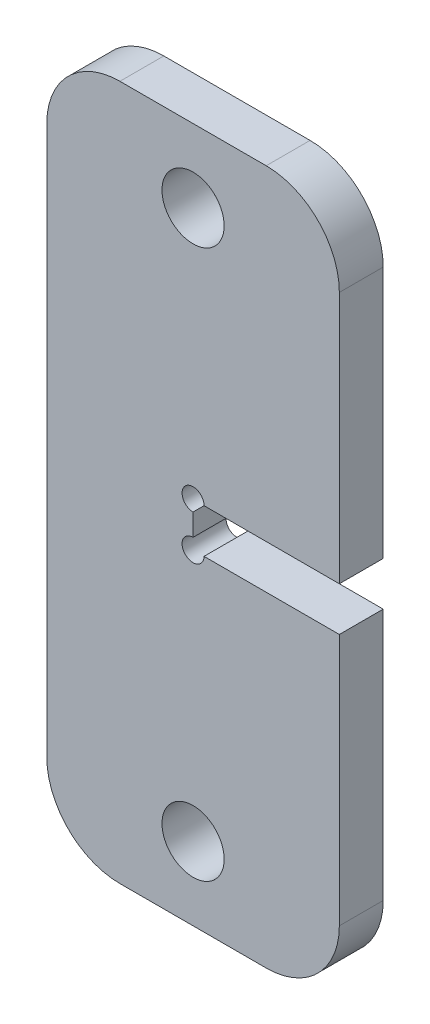
ISO-10303-21;
HEADER;
FILE_DESCRIPTION(('STEP AP214'),'2;1');
FILE_NAME('part.step','',(''),(''),'','','');
FILE_SCHEMA(('AUTOMOTIVE_DESIGN { 1 0 10303 214 1 1 1 1 }'));
ENDSEC;
DATA;
#1=APPLICATION_CONTEXT('core data for automotive mechanical design processes');
#2=APPLICATION_PROTOCOL_DEFINITION('international standard','automotive_design',2000,#1);
#3=PRODUCT_CONTEXT('',#1,'mechanical');
#4=PRODUCT('Part','Part','',(#3));
#5=PRODUCT_RELATED_PRODUCT_CATEGORY('part','',(#4));
#6=PRODUCT_DEFINITION_FORMATION('','',#4);
#7=PRODUCT_DEFINITION_CONTEXT('part definition',#1,'design');
#8=PRODUCT_DEFINITION('design','',#6,#7);
#9=PRODUCT_DEFINITION_SHAPE('','',#8);
#10=(LENGTH_UNIT() NAMED_UNIT(*) SI_UNIT(.MILLI.,.METRE.));
#11=(NAMED_UNIT(*) PLANE_ANGLE_UNIT() SI_UNIT($,.RADIAN.));
#12=(NAMED_UNIT(*) SI_UNIT($,.STERADIAN.) SOLID_ANGLE_UNIT());
#13=UNCERTAINTY_MEASURE_WITH_UNIT(LENGTH_MEASURE(1.E-05),#10,'distance_accuracy_value','');
#14=(GEOMETRIC_REPRESENTATION_CONTEXT(3) GLOBAL_UNCERTAINTY_ASSIGNED_CONTEXT((#13)) GLOBAL_UNIT_ASSIGNED_CONTEXT((#10,
#11,#12)) REPRESENTATION_CONTEXT('',''));
#15=CARTESIAN_POINT('',(0.,0.,0.));
#16=DIRECTION('',(0.,0.,1.));
#17=DIRECTION('',(1.,0.,0.));
#18=AXIS2_PLACEMENT_3D('',#15,#16,#17);
#19=CARTESIAN_POINT('',(681.,310.,6.00000000000001));
#20=DIRECTION('',(0.,0.,1.));
#21=DIRECTION('',(1.,0.,0.));
#22=AXIS2_PLACEMENT_3D('',#19,#20,#21);
#23=PLANE('',#22);
#24=CARTESIAN_POINT('',(691.,350.5,6.00000000000001));
#25=DIRECTION('',(0.,0.,1.));
#26=DIRECTION('',(1.,0.,0.));
#27=AXIS2_PLACEMENT_3D('',#24,#25,#26);
#28=CIRCLE('',#27,1.49999999999997);
#29=CARTESIAN_POINT('',(692.5,350.5,6.00000000000001));
#30=VERTEX_POINT('',#29);
#31=CARTESIAN_POINT('',(691.,349.,6.00000000000001));
#32=VERTEX_POINT('',#31);
#33=EDGE_CURVE('E140',#30,#32,#28,.T.);
#34=ORIENTED_EDGE('',*,*,#33,.F.);
#35=DIRECTION('',(1.,0.,0.));
#36=VECTOR('',#35,1.);
#37=CARTESIAN_POINT('',(691.,350.5,6.00000000000001));
#38=LINE('',#37,#36);
#39=CARTESIAN_POINT('',(711.,350.5,6.00000000000001));
#40=VERTEX_POINT('',#39);
#41=EDGE_CURVE('E150',#30,#40,#38,.T.);
#42=ORIENTED_EDGE('',*,*,#41,.T.);
#43=DIRECTION('',(0.,1.,0.));
#44=VECTOR('',#43,1.);
#45=CARTESIAN_POINT('',(711.,350.5,6.00000000000001));
#46=LINE('',#45,#44);
#47=CARTESIAN_POINT('',(711.,385.,6.00000000000001));
#48=VERTEX_POINT('',#47);
#49=EDGE_CURVE('E162',#40,#48,#46,.T.);
#50=ORIENTED_EDGE('',*,*,#49,.T.);
#51=CARTESIAN_POINT('',(701.,385.,6.00000000000001));
#52=DIRECTION('',(0.,0.,1.));
#53=DIRECTION('',(1.,0.,0.));
#54=AXIS2_PLACEMENT_3D('',#51,#52,#53);
#55=CIRCLE('',#54,10.);
#56=CARTESIAN_POINT('',(701.,395.,6.00000000000001));
#57=VERTEX_POINT('',#56);
#58=EDGE_CURVE('E167',#48,#57,#55,.T.);
#59=ORIENTED_EDGE('',*,*,#58,.T.);
#60=DIRECTION('',(-1.,0.,0.));
#61=VECTOR('',#60,1.);
#62=CARTESIAN_POINT('',(701.,395.,6.00000000000001));
#63=LINE('',#62,#61);
#64=CARTESIAN_POINT('',(681.,395.,6.00000000000001));
#65=VERTEX_POINT('',#64);
#66=EDGE_CURVE('E175',#57,#65,#63,.T.);
#67=ORIENTED_EDGE('',*,*,#66,.T.);
#68=CARTESIAN_POINT('',(681.,385.,6.00000000000001));
#69=DIRECTION('',(0.,0.,1.));
#70=DIRECTION('',(1.,0.,0.));
#71=AXIS2_PLACEMENT_3D('',#68,#69,#70);
#72=CIRCLE('',#71,10.);
#73=CARTESIAN_POINT('',(671.,385.,6.00000000000001));
#74=VERTEX_POINT('',#73);
#75=EDGE_CURVE('E178',#65,#74,#72,.T.);
#76=ORIENTED_EDGE('',*,*,#75,.T.);
#77=DIRECTION('',(0.,-1.,0.));
#78=VECTOR('',#77,1.);
#79=CARTESIAN_POINT('',(671.,385.,6.00000000000001));
#80=LINE('',#79,#78);
#81=CARTESIAN_POINT('',(671.,310.,6.00000000000001));
#82=VERTEX_POINT('',#81);
#83=EDGE_CURVE('E181',#74,#82,#80,.T.);
#84=ORIENTED_EDGE('',*,*,#83,.T.);
#85=CARTESIAN_POINT('',(681.,310.,6.00000000000001));
#86=DIRECTION('',(0.,0.,1.));
#87=DIRECTION('',(1.,0.,0.));
#88=AXIS2_PLACEMENT_3D('',#85,#86,#87);
#89=CIRCLE('',#88,10.);
#90=CARTESIAN_POINT('',(681.,300.,6.00000000000001));
#91=VERTEX_POINT('',#90);
#92=EDGE_CURVE('E225',#82,#91,#89,.T.);
#93=ORIENTED_EDGE('',*,*,#92,.T.);
#94=DIRECTION('',(1.,0.,0.));
#95=VECTOR('',#94,1.);
#96=CARTESIAN_POINT('',(681.,300.,6.00000000000001));
#97=LINE('',#96,#95);
#98=CARTESIAN_POINT('',(701.,300.,6.00000000000001));
#99=VERTEX_POINT('',#98);
#100=EDGE_CURVE('E266',#91,#99,#97,.T.);
#101=ORIENTED_EDGE('',*,*,#100,.T.);
#102=CARTESIAN_POINT('',(701.,310.,6.00000000000001));
#103=DIRECTION('',(0.,0.,1.));
#104=DIRECTION('',(1.,0.,0.));
#105=AXIS2_PLACEMENT_3D('',#102,#103,#104);
#106=CIRCLE('',#105,10.);
#107=CARTESIAN_POINT('',(711.,310.,6.00000000000001));
#108=VERTEX_POINT('',#107);
#109=EDGE_CURVE('E292',#99,#108,#106,.T.);
#110=ORIENTED_EDGE('',*,*,#109,.T.);
#111=DIRECTION('',(0.,1.,0.));
#112=VECTOR('',#111,1.);
#113=CARTESIAN_POINT('',(711.,310.,6.00000000000001));
#114=LINE('',#113,#112);
#115=CARTESIAN_POINT('',(711.,344.5,6.00000000000001));
#116=VERTEX_POINT('',#115);
#117=EDGE_CURVE('E288',#108,#116,#114,.T.);
#118=ORIENTED_EDGE('',*,*,#117,.T.);
#119=DIRECTION('',(-1.,0.,0.));
#120=VECTOR('',#119,1.);
#121=CARTESIAN_POINT('',(691.,344.5,6.00000000000001));
#122=LINE('',#121,#120);
#123=CARTESIAN_POINT('',(692.5,344.5,6.00000000000001));
#124=VERTEX_POINT('',#123);
#125=EDGE_CURVE('E170',#116,#124,#122,.T.);
#126=ORIENTED_EDGE('',*,*,#125,.T.);
#127=CARTESIAN_POINT('',(691.,344.5,6.00000000000001));
#128=DIRECTION('',(0.,0.,1.));
#129=DIRECTION('',(1.,0.,0.));
#130=AXIS2_PLACEMENT_3D('',#127,#128,#129);
#131=CIRCLE('',#130,1.49999999999997);
#132=CARTESIAN_POINT('',(691.,346.,6.00000000000001));
#133=VERTEX_POINT('',#132);
#134=EDGE_CURVE('E324',#133,#124,#131,.T.);
#135=ORIENTED_EDGE('',*,*,#134,.F.);
#136=DIRECTION('',(0.,1.,0.));
#137=VECTOR('',#136,1.);
#138=CARTESIAN_POINT('',(691.,350.5,6.00000000000001));
#139=LINE('',#138,#137);
#140=EDGE_CURVE('E154',#133,#32,#139,.T.);
#141=ORIENTED_EDGE('',*,*,#140,.T.);
#142=EDGE_LOOP('',(#34,#42,#50,#59,#67,#76,#84,#93,#101,#110,#118,#126,#135,#141));
#143=FACE_BOUND('',#142,.T.);
#144=CARTESIAN_POINT('',(691.,310.,6.00000000000001));
#145=DIRECTION('',(0.,0.,1.));
#146=DIRECTION('',(1.,0.,0.));
#147=AXIS2_PLACEMENT_3D('',#144,#145,#146);
#148=CIRCLE('',#147,4.25000000000001);
#149=CARTESIAN_POINT('',(695.25,310.,6.00000000000001));
#150=VERTEX_POINT('',#149);
#151=EDGE_CURVE('E190',#150,#150,#148,.T.);
#152=ORIENTED_EDGE('',*,*,#151,.F.);
#153=EDGE_LOOP('',(#152));
#154=FACE_BOUND('',#153,.T.);
#155=CARTESIAN_POINT('',(691.,385.,6.00000000000001));
#156=DIRECTION('',(0.,0.,1.));
#157=DIRECTION('',(1.,0.,0.));
#158=AXIS2_PLACEMENT_3D('',#155,#156,#157);
#159=CIRCLE('',#158,4.25000000000001);
#160=CARTESIAN_POINT('',(695.25,385.,6.00000000000001));
#161=VERTEX_POINT('',#160);
#162=EDGE_CURVE('E306',#161,#161,#159,.T.);
#163=ORIENTED_EDGE('',*,*,#162,.F.);
#164=EDGE_LOOP('',(#163));
#165=FACE_BOUND('',#164,.T.);
#166=ADVANCED_FACE('F40',(#143,#154,#165),#23,.T.);
#167=CARTESIAN_POINT('',(681.,310.,0.));
#168=DIRECTION('',(0.,0.,1.));
#169=DIRECTION('',(1.,0.,0.));
#170=AXIS2_PLACEMENT_3D('',#167,#168,#169);
#171=PLANE('',#170);
#172=DIRECTION('',(1.,0.,0.));
#173=VECTOR('',#172,1.);
#174=CARTESIAN_POINT('',(691.,350.5,0.));
#175=LINE('',#174,#173);
#176=CARTESIAN_POINT('',(692.5,350.5,0.));
#177=VERTEX_POINT('',#176);
#178=CARTESIAN_POINT('',(711.,350.5,0.));
#179=VERTEX_POINT('',#178);
#180=EDGE_CURVE('E207',#177,#179,#175,.T.);
#181=ORIENTED_EDGE('',*,*,#180,.F.);
#182=CARTESIAN_POINT('',(691.,350.5,0.));
#183=DIRECTION('',(0.,0.,1.));
#184=DIRECTION('',(1.,0.,0.));
#185=AXIS2_PLACEMENT_3D('',#182,#183,#184);
#186=CIRCLE('',#185,1.49999999999997);
#187=CARTESIAN_POINT('',(691.,349.,0.));
#188=VERTEX_POINT('',#187);
#189=EDGE_CURVE('E63',#177,#188,#186,.T.);
#190=ORIENTED_EDGE('',*,*,#189,.T.);
#191=DIRECTION('',(0.,1.,0.));
#192=VECTOR('',#191,1.);
#193=CARTESIAN_POINT('',(691.,350.5,0.));
#194=LINE('',#193,#192);
#195=CARTESIAN_POINT('',(691.,346.,0.));
#196=VERTEX_POINT('',#195);
#197=EDGE_CURVE('E203',#196,#188,#194,.T.);
#198=ORIENTED_EDGE('',*,*,#197,.F.);
#199=CARTESIAN_POINT('',(691.,344.5,0.));
#200=DIRECTION('',(0.,0.,1.));
#201=DIRECTION('',(1.,0.,0.));
#202=AXIS2_PLACEMENT_3D('',#199,#200,#201);
#203=CIRCLE('',#202,1.49999999999997);
#204=CARTESIAN_POINT('',(692.5,344.5,0.));
#205=VERTEX_POINT('',#204);
#206=EDGE_CURVE('E56',#196,#205,#203,.T.);
#207=ORIENTED_EDGE('',*,*,#206,.T.);
#208=DIRECTION('',(-1.,0.,0.));
#209=VECTOR('',#208,1.);
#210=CARTESIAN_POINT('',(691.,344.5,0.));
#211=LINE('',#210,#209);
#212=CARTESIAN_POINT('',(711.,344.5,0.));
#213=VERTEX_POINT('',#212);
#214=EDGE_CURVE('E199',#213,#205,#211,.T.);
#215=ORIENTED_EDGE('',*,*,#214,.F.);
#216=DIRECTION('',(0.,1.,0.));
#217=VECTOR('',#216,1.);
#218=CARTESIAN_POINT('',(711.,310.,0.));
#219=LINE('',#218,#217);
#220=CARTESIAN_POINT('',(711.,310.,0.));
#221=VERTEX_POINT('',#220);
#222=EDGE_CURVE('E196',#221,#213,#219,.T.);
#223=ORIENTED_EDGE('',*,*,#222,.F.);
#224=CARTESIAN_POINT('',(701.,310.,0.));
#225=DIRECTION('',(0.,0.,1.));
#226=DIRECTION('',(1.,0.,0.));
#227=AXIS2_PLACEMENT_3D('',#224,#225,#226);
#228=CIRCLE('',#227,10.);
#229=CARTESIAN_POINT('',(701.,300.,0.));
#230=VERTEX_POINT('',#229);
#231=EDGE_CURVE('E193',#230,#221,#228,.T.);
#232=ORIENTED_EDGE('',*,*,#231,.F.);
#233=DIRECTION('',(1.,0.,0.));
#234=VECTOR('',#233,1.);
#235=CARTESIAN_POINT('',(681.,300.,0.));
#236=LINE('',#235,#234);
#237=CARTESIAN_POINT('',(681.,300.,0.));
#238=VERTEX_POINT('',#237);
#239=EDGE_CURVE('E189',#238,#230,#236,.T.);
#240=ORIENTED_EDGE('',*,*,#239,.F.);
#241=CARTESIAN_POINT('',(681.,310.,0.));
#242=DIRECTION('',(0.,0.,1.));
#243=DIRECTION('',(1.,0.,0.));
#244=AXIS2_PLACEMENT_3D('',#241,#242,#243);
#245=CIRCLE('',#244,10.);
#246=CARTESIAN_POINT('',(671.,310.,0.));
#247=VERTEX_POINT('',#246);
#248=EDGE_CURVE('E185',#247,#238,#245,.T.);
#249=ORIENTED_EDGE('',*,*,#248,.F.);
#250=DIRECTION('',(0.,-1.,0.));
#251=VECTOR('',#250,1.);
#252=CARTESIAN_POINT('',(671.,385.,0.));
#253=LINE('',#252,#251);
#254=CARTESIAN_POINT('',(671.,385.,0.));
#255=VERTEX_POINT('',#254);
#256=EDGE_CURVE('E222',#255,#247,#253,.T.);
#257=ORIENTED_EDGE('',*,*,#256,.F.);
#258=CARTESIAN_POINT('',(681.,385.,0.));
#259=DIRECTION('',(0.,0.,1.));
#260=DIRECTION('',(1.,0.,0.));
#261=AXIS2_PLACEMENT_3D('',#258,#259,#260);
#262=CIRCLE('',#261,10.);
#263=CARTESIAN_POINT('',(681.,395.,0.));
#264=VERTEX_POINT('',#263);
#265=EDGE_CURVE('E219',#264,#255,#262,.T.);
#266=ORIENTED_EDGE('',*,*,#265,.F.);
#267=DIRECTION('',(-1.,0.,0.));
#268=VECTOR('',#267,1.);
#269=CARTESIAN_POINT('',(701.,395.,0.));
#270=LINE('',#269,#268);
#271=CARTESIAN_POINT('',(701.,395.,0.));
#272=VERTEX_POINT('',#271);
#273=EDGE_CURVE('E216',#272,#264,#270,.T.);
#274=ORIENTED_EDGE('',*,*,#273,.F.);
#275=CARTESIAN_POINT('',(701.,385.,0.));
#276=DIRECTION('',(0.,0.,1.));
#277=DIRECTION('',(1.,0.,0.));
#278=AXIS2_PLACEMENT_3D('',#275,#276,#277);
#279=CIRCLE('',#278,10.);
#280=CARTESIAN_POINT('',(711.,385.,0.));
#281=VERTEX_POINT('',#280);
#282=EDGE_CURVE('E213',#281,#272,#279,.T.);
#283=ORIENTED_EDGE('',*,*,#282,.F.);
#284=DIRECTION('',(0.,1.,0.));
#285=VECTOR('',#284,1.);
#286=CARTESIAN_POINT('',(711.,350.5,0.));
#287=LINE('',#286,#285);
#288=EDGE_CURVE('E210',#179,#281,#287,.T.);
#289=ORIENTED_EDGE('',*,*,#288,.F.);
#290=EDGE_LOOP('',(#181,#190,#198,#207,#215,#223,#232,#240,#249,#257,#266,#274,#283,#289));
#291=FACE_BOUND('',#290,.T.);
#292=CARTESIAN_POINT('',(691.,310.,0.));
#293=DIRECTION('',(0.,0.,1.));
#294=DIRECTION('',(1.,0.,0.));
#295=AXIS2_PLACEMENT_3D('',#292,#293,#294);
#296=CIRCLE('',#295,4.25000000000001);
#297=CARTESIAN_POINT('',(695.25,310.,0.));
#298=VERTEX_POINT('',#297);
#299=EDGE_CURVE('E302',#298,#298,#296,.T.);
#300=ORIENTED_EDGE('',*,*,#299,.T.);
#301=EDGE_LOOP('',(#300));
#302=FACE_BOUND('',#301,.T.);
#303=CARTESIAN_POINT('',(691.,385.,0.));
#304=DIRECTION('',(0.,0.,1.));
#305=DIRECTION('',(1.,0.,0.));
#306=AXIS2_PLACEMENT_3D('',#303,#304,#305);
#307=CIRCLE('',#306,4.25000000000001);
#308=CARTESIAN_POINT('',(695.25,385.,0.));
#309=VERTEX_POINT('',#308);
#310=EDGE_CURVE('E310',#309,#309,#307,.T.);
#311=ORIENTED_EDGE('',*,*,#310,.T.);
#312=EDGE_LOOP('',(#311));
#313=FACE_BOUND('',#312,.T.);
#314=ADVANCED_FACE('F274',(#291,#302,#313),#171,.F.);
#315=CARTESIAN_POINT('',(681.,310.,6.00000000000001));
#316=DIRECTION('',(0.,0.,-1.));
#317=DIRECTION('',(-1.,0.,0.));
#318=AXIS2_PLACEMENT_3D('',#315,#316,#317);
#319=CYLINDRICAL_SURFACE('',#318,10.);
#320=ORIENTED_EDGE('',*,*,#248,.T.);
#321=DIRECTION('',(0.,0.,-1.));
#322=VECTOR('',#321,1.);
#323=CARTESIAN_POINT('',(681.,300.,6.00000000000001));
#324=LINE('',#323,#322);
#325=EDGE_CURVE('E146',#91,#238,#324,.T.);
#326=ORIENTED_EDGE('',*,*,#325,.F.);
#327=ORIENTED_EDGE('',*,*,#92,.F.);
#328=DIRECTION('',(0.,0.,-1.));
#329=VECTOR('',#328,1.);
#330=CARTESIAN_POINT('',(671.,310.,6.00000000000001));
#331=LINE('',#330,#329);
#332=EDGE_CURVE('E184',#82,#247,#331,.T.);
#333=ORIENTED_EDGE('',*,*,#332,.T.);
#334=EDGE_LOOP('',(#320,#326,#327,#333));
#335=FACE_BOUND('',#334,.T.);
#336=ADVANCED_FACE('F42',(#335),#319,.T.);
#337=CARTESIAN_POINT('',(681.,300.,6.00000000000001));
#338=DIRECTION('',(0.,1.,0.));
#339=DIRECTION('',(0.,0.,1.));
#340=AXIS2_PLACEMENT_3D('',#337,#338,#339);
#341=PLANE('',#340);
#342=ORIENTED_EDGE('',*,*,#239,.T.);
#343=DIRECTION('',(0.,0.,-1.));
#344=VECTOR('',#343,1.);
#345=CARTESIAN_POINT('',(701.,300.,6.00000000000001));
#346=LINE('',#345,#344);
#347=EDGE_CURVE('E254',#99,#230,#346,.T.);
#348=ORIENTED_EDGE('',*,*,#347,.F.);
#349=ORIENTED_EDGE('',*,*,#100,.F.);
#350=ORIENTED_EDGE('',*,*,#325,.T.);
#351=EDGE_LOOP('',(#342,#348,#349,#350));
#352=FACE_BOUND('',#351,.T.);
#353=ADVANCED_FACE('F264',(#352),#341,.F.);
#354=CARTESIAN_POINT('',(701.,310.,6.00000000000001));
#355=DIRECTION('',(0.,0.,-1.));
#356=DIRECTION('',(-1.,0.,0.));
#357=AXIS2_PLACEMENT_3D('',#354,#355,#356);
#358=CYLINDRICAL_SURFACE('',#357,10.);
#359=ORIENTED_EDGE('',*,*,#231,.T.);
#360=DIRECTION('',(0.,0.,-1.));
#361=VECTOR('',#360,1.);
#362=CARTESIAN_POINT('',(711.,310.,6.00000000000001));
#363=LINE('',#362,#361);
#364=EDGE_CURVE('E250',#108,#221,#363,.T.);
#365=ORIENTED_EDGE('',*,*,#364,.F.);
#366=ORIENTED_EDGE('',*,*,#109,.F.);
#367=ORIENTED_EDGE('',*,*,#347,.T.);
#368=EDGE_LOOP('',(#359,#365,#366,#367));
#369=FACE_BOUND('',#368,.T.);
#370=ADVANCED_FACE('F282',(#369),#358,.T.);
#371=CARTESIAN_POINT('',(711.,310.,6.00000000000001));
#372=DIRECTION('',(-1.,0.,0.));
#373=DIRECTION('',(0.,0.,1.));
#374=AXIS2_PLACEMENT_3D('',#371,#372,#373);
#375=PLANE('',#374);
#376=ORIENTED_EDGE('',*,*,#222,.T.);
#377=DIRECTION('',(0.,0.,-1.));
#378=VECTOR('',#377,1.);
#379=CARTESIAN_POINT('',(711.,344.5,6.00000000000001));
#380=LINE('',#379,#378);
#381=EDGE_CURVE('E246',#116,#213,#380,.T.);
#382=ORIENTED_EDGE('',*,*,#381,.F.);
#383=ORIENTED_EDGE('',*,*,#117,.F.);
#384=ORIENTED_EDGE('',*,*,#364,.T.);
#385=EDGE_LOOP('',(#376,#382,#383,#384));
#386=FACE_BOUND('',#385,.T.);
#387=ADVANCED_FACE('F286',(#386),#375,.F.);
#388=CARTESIAN_POINT('',(691.,344.5,6.00000000000001));
#389=DIRECTION('',(0.,-1.,0.));
#390=DIRECTION('',(0.,0.,-1.));
#391=AXIS2_PLACEMENT_3D('',#388,#389,#390);
#392=PLANE('',#391);
#393=ORIENTED_EDGE('',*,*,#214,.T.);
#394=DIRECTION('',(0.,0.,1.));
#395=VECTOR('',#394,1.);
#396=CARTESIAN_POINT('',(692.5,344.5,0.));
#397=LINE('',#396,#395);
#398=EDGE_CURVE('E314',#205,#124,#397,.T.);
#399=ORIENTED_EDGE('',*,*,#398,.T.);
#400=ORIENTED_EDGE('',*,*,#125,.F.);
#401=ORIENTED_EDGE('',*,*,#381,.T.);
#402=EDGE_LOOP('',(#393,#399,#400,#401));
#403=FACE_BOUND('',#402,.T.);
#404=ADVANCED_FACE('F334',(#403),#392,.F.);
#405=CARTESIAN_POINT('',(691.,350.5,6.00000000000001));
#406=DIRECTION('',(-1.,0.,0.));
#407=DIRECTION('',(0.,0.,1.));
#408=AXIS2_PLACEMENT_3D('',#405,#406,#407);
#409=PLANE('',#408);
#410=ORIENTED_EDGE('',*,*,#197,.T.);
#411=DIRECTION('',(0.,0.,1.));
#412=VECTOR('',#411,1.);
#413=CARTESIAN_POINT('',(691.,349.,0.));
#414=LINE('',#413,#412);
#415=EDGE_CURVE('E321',#188,#32,#414,.T.);
#416=ORIENTED_EDGE('',*,*,#415,.T.);
#417=ORIENTED_EDGE('',*,*,#140,.F.);
#418=DIRECTION('',(0.,0.,1.));
#419=VECTOR('',#418,1.);
#420=CARTESIAN_POINT('',(691.,346.,0.));
#421=LINE('',#420,#419);
#422=EDGE_CURVE('E11',#133,#196,#421,.F.);
#423=ORIENTED_EDGE('',*,*,#422,.T.);
#424=EDGE_LOOP('',(#410,#416,#417,#423));
#425=FACE_BOUND('',#424,.T.);
#426=ADVANCED_FACE('F331',(#425),#409,.F.);
#427=CARTESIAN_POINT('',(691.,350.5,6.00000000000001));
#428=DIRECTION('',(0.,1.,0.));
#429=DIRECTION('',(0.,0.,1.));
#430=AXIS2_PLACEMENT_3D('',#427,#428,#429);
#431=PLANE('',#430);
#432=ORIENTED_EDGE('',*,*,#41,.F.);
#433=DIRECTION('',(0.,0.,1.));
#434=VECTOR('',#433,1.);
#435=CARTESIAN_POINT('',(692.5,350.5,0.));
#436=LINE('',#435,#434);
#437=EDGE_CURVE('E49',#30,#177,#436,.F.);
#438=ORIENTED_EDGE('',*,*,#437,.T.);
#439=ORIENTED_EDGE('',*,*,#180,.T.);
#440=DIRECTION('',(0.,0.,-1.));
#441=VECTOR('',#440,1.);
#442=CARTESIAN_POINT('',(711.,350.5,6.00000000000001));
#443=LINE('',#442,#441);
#444=EDGE_CURVE('E159',#40,#179,#443,.T.);
#445=ORIENTED_EDGE('',*,*,#444,.F.);
#446=EDGE_LOOP('',(#432,#438,#439,#445));
#447=FACE_BOUND('',#446,.T.);
#448=ADVANCED_FACE('F157',(#447),#431,.F.);
#449=CARTESIAN_POINT('',(711.,350.5,6.00000000000001));
#450=DIRECTION('',(-1.,0.,0.));
#451=DIRECTION('',(0.,0.,1.));
#452=AXIS2_PLACEMENT_3D('',#449,#450,#451);
#453=PLANE('',#452);
#454=ORIENTED_EDGE('',*,*,#288,.T.);
#455=DIRECTION('',(0.,0.,-1.));
#456=VECTOR('',#455,1.);
#457=CARTESIAN_POINT('',(711.,385.,6.00000000000001));
#458=LINE('',#457,#456);
#459=EDGE_CURVE('E240',#48,#281,#458,.T.);
#460=ORIENTED_EDGE('',*,*,#459,.F.);
#461=ORIENTED_EDGE('',*,*,#49,.F.);
#462=ORIENTED_EDGE('',*,*,#444,.T.);
#463=EDGE_LOOP('',(#454,#460,#461,#462));
#464=FACE_BOUND('',#463,.T.);
#465=ADVANCED_FACE('F368',(#464),#453,.F.);
#466=CARTESIAN_POINT('',(701.,385.,6.00000000000001));
#467=DIRECTION('',(0.,0.,-1.));
#468=DIRECTION('',(-1.,0.,0.));
#469=AXIS2_PLACEMENT_3D('',#466,#467,#468);
#470=CYLINDRICAL_SURFACE('',#469,10.);
#471=ORIENTED_EDGE('',*,*,#282,.T.);
#472=DIRECTION('',(0.,0.,-1.));
#473=VECTOR('',#472,1.);
#474=CARTESIAN_POINT('',(701.,395.,6.00000000000001));
#475=LINE('',#474,#473);
#476=EDGE_CURVE('E236',#57,#272,#475,.T.);
#477=ORIENTED_EDGE('',*,*,#476,.F.);
#478=ORIENTED_EDGE('',*,*,#58,.F.);
#479=ORIENTED_EDGE('',*,*,#459,.T.);
#480=EDGE_LOOP('',(#471,#477,#478,#479));
#481=FACE_BOUND('',#480,.T.);
#482=ADVANCED_FACE('F364',(#481),#470,.T.);
#483=CARTESIAN_POINT('',(701.,395.,6.00000000000001));
#484=DIRECTION('',(0.,-1.,0.));
#485=DIRECTION('',(0.,0.,-1.));
#486=AXIS2_PLACEMENT_3D('',#483,#484,#485);
#487=PLANE('',#486);
#488=ORIENTED_EDGE('',*,*,#273,.T.);
#489=DIRECTION('',(0.,0.,-1.));
#490=VECTOR('',#489,1.);
#491=CARTESIAN_POINT('',(681.,395.,6.00000000000001));
#492=LINE('',#491,#490);
#493=EDGE_CURVE('E233',#65,#264,#492,.T.);
#494=ORIENTED_EDGE('',*,*,#493,.F.);
#495=ORIENTED_EDGE('',*,*,#66,.F.);
#496=ORIENTED_EDGE('',*,*,#476,.T.);
#497=EDGE_LOOP('',(#488,#494,#495,#496));
#498=FACE_BOUND('',#497,.T.);
#499=ADVANCED_FACE('F360',(#498),#487,.F.);
#500=CARTESIAN_POINT('',(681.,385.,6.00000000000001));
#501=DIRECTION('',(0.,0.,-1.));
#502=DIRECTION('',(-1.,0.,0.));
#503=AXIS2_PLACEMENT_3D('',#500,#501,#502);
#504=CYLINDRICAL_SURFACE('',#503,10.);
#505=ORIENTED_EDGE('',*,*,#265,.T.);
#506=DIRECTION('',(0.,0.,-1.));
#507=VECTOR('',#506,1.);
#508=CARTESIAN_POINT('',(671.,385.,6.00000000000001));
#509=LINE('',#508,#507);
#510=EDGE_CURVE('E229',#74,#255,#509,.T.);
#511=ORIENTED_EDGE('',*,*,#510,.F.);
#512=ORIENTED_EDGE('',*,*,#75,.F.);
#513=ORIENTED_EDGE('',*,*,#493,.T.);
#514=EDGE_LOOP('',(#505,#511,#512,#513));
#515=FACE_BOUND('',#514,.T.);
#516=ADVANCED_FACE('F356',(#515),#504,.T.);
#517=CARTESIAN_POINT('',(671.,385.,6.00000000000001));
#518=DIRECTION('',(1.,0.,0.));
#519=DIRECTION('',(0.,0.,-1.));
#520=AXIS2_PLACEMENT_3D('',#517,#518,#519);
#521=PLANE('',#520);
#522=ORIENTED_EDGE('',*,*,#256,.T.);
#523=ORIENTED_EDGE('',*,*,#332,.F.);
#524=ORIENTED_EDGE('',*,*,#83,.F.);
#525=ORIENTED_EDGE('',*,*,#510,.T.);
#526=EDGE_LOOP('',(#522,#523,#524,#525));
#527=FACE_BOUND('',#526,.T.);
#528=ADVANCED_FACE('F353',(#527),#521,.F.);
#529=CARTESIAN_POINT('',(691.,310.,6.00000000000001));
#530=DIRECTION('',(0.,0.,-1.));
#531=DIRECTION('',(-1.,0.,0.));
#532=AXIS2_PLACEMENT_3D('',#529,#530,#531);
#533=CYLINDRICAL_SURFACE('',#532,4.25000000000001);
#534=ORIENTED_EDGE('',*,*,#151,.T.);
#535=EDGE_LOOP('',(#534));
#536=FACE_BOUND('',#535,.T.);
#537=ORIENTED_EDGE('',*,*,#299,.F.);
#538=EDGE_LOOP('',(#537));
#539=FACE_BOUND('',#538,.T.);
#540=ADVANCED_FACE('F350',(#536,#539),#533,.F.);
#541=CARTESIAN_POINT('',(691.,385.,6.00000000000001));
#542=DIRECTION('',(0.,0.,-1.));
#543=DIRECTION('',(-1.,0.,0.));
#544=AXIS2_PLACEMENT_3D('',#541,#542,#543);
#545=CYLINDRICAL_SURFACE('',#544,4.25000000000001);
#546=ORIENTED_EDGE('',*,*,#162,.T.);
#547=EDGE_LOOP('',(#546));
#548=FACE_BOUND('',#547,.T.);
#549=ORIENTED_EDGE('',*,*,#310,.F.);
#550=EDGE_LOOP('',(#549));
#551=FACE_BOUND('',#550,.T.);
#552=ADVANCED_FACE('F404',(#548,#551),#545,.F.);
#553=CARTESIAN_POINT('',(691.,350.5,0.));
#554=DIRECTION('',(0.,0.,1.));
#555=DIRECTION('',(1.,0.,0.));
#556=AXIS2_PLACEMENT_3D('',#553,#554,#555);
#557=CYLINDRICAL_SURFACE('',#556,1.49999999999997);
#558=ORIENTED_EDGE('',*,*,#189,.F.);
#559=ORIENTED_EDGE('',*,*,#437,.F.);
#560=ORIENTED_EDGE('',*,*,#33,.T.);
#561=ORIENTED_EDGE('',*,*,#415,.F.);
#562=EDGE_LOOP('',(#558,#559,#560,#561));
#563=FACE_BOUND('',#562,.T.);
#564=ADVANCED_FACE('F139',(#563),#557,.F.);
#565=CARTESIAN_POINT('',(691.,344.5,0.));
#566=DIRECTION('',(0.,0.,1.));
#567=DIRECTION('',(1.,0.,0.));
#568=AXIS2_PLACEMENT_3D('',#565,#566,#567);
#569=CYLINDRICAL_SURFACE('',#568,1.49999999999997);
#570=ORIENTED_EDGE('',*,*,#206,.F.);
#571=ORIENTED_EDGE('',*,*,#422,.F.);
#572=ORIENTED_EDGE('',*,*,#134,.T.);
#573=ORIENTED_EDGE('',*,*,#398,.F.);
#574=EDGE_LOOP('',(#570,#571,#572,#573));
#575=FACE_BOUND('',#574,.T.);
#576=ADVANCED_FACE('F332',(#575),#569,.F.);
#577=CLOSED_SHELL('',(#166,#314,#336,#353,#370,#387,#404,#426,#448,#465,#482,#499,#516,#528,
#540,#552,#564,#576));
#578=MANIFOLD_SOLID_BREP('B2',#577);
#579=ADVANCED_BREP_SHAPE_REPRESENTATION('',(#18,#578),#14);
#580=SHAPE_DEFINITION_REPRESENTATION(#9,#579);
ENDSEC;
END-ISO-10303-21;
